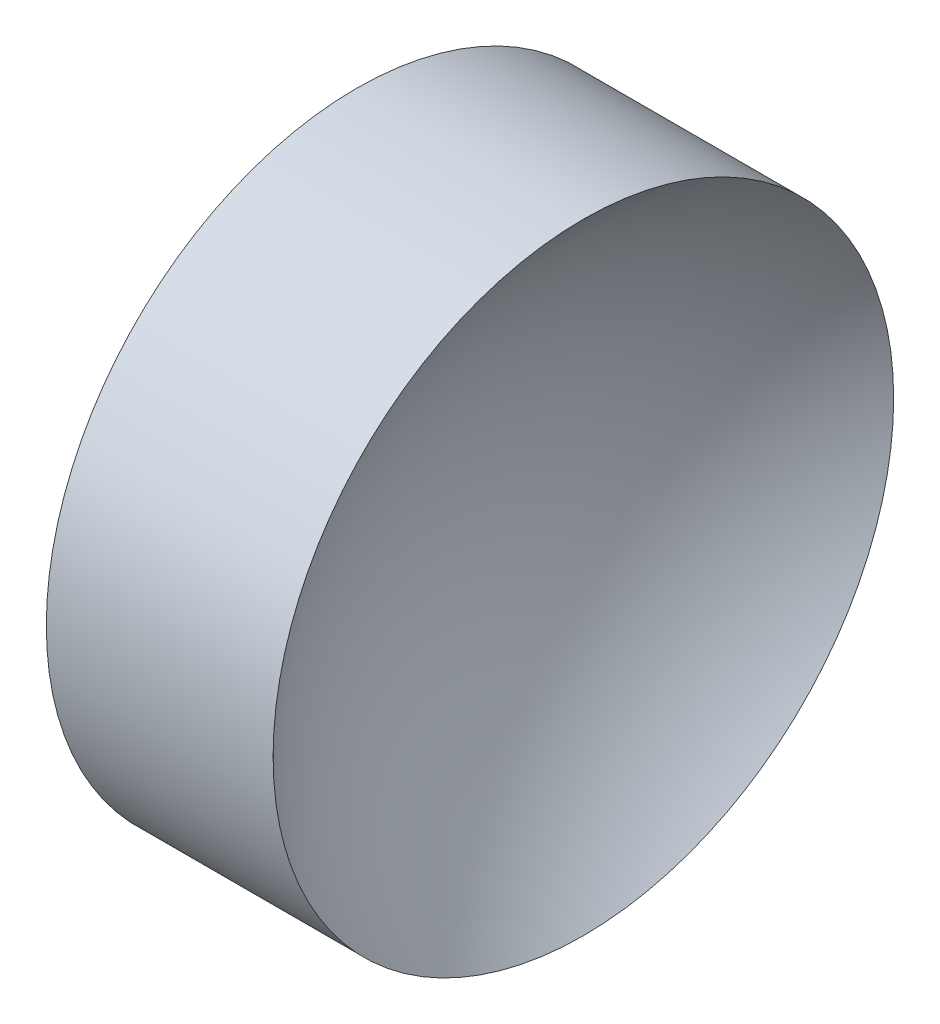
ISO-10303-21;
HEADER;
FILE_DESCRIPTION(('STEP AP214'),'2;1');
FILE_NAME('part.step','',(''),(''),'','','');
FILE_SCHEMA(('AUTOMOTIVE_DESIGN { 1 0 10303 214 1 1 1 1 }'));
ENDSEC;
DATA;
#1=APPLICATION_CONTEXT('core data for automotive mechanical design processes');
#2=APPLICATION_PROTOCOL_DEFINITION('international standard','automotive_design',2000,#1);
#3=PRODUCT_CONTEXT('',#1,'mechanical');
#4=PRODUCT('Part','Part','',(#3));
#5=PRODUCT_RELATED_PRODUCT_CATEGORY('part','',(#4));
#6=PRODUCT_DEFINITION_FORMATION('','',#4);
#7=PRODUCT_DEFINITION_CONTEXT('part definition',#1,'design');
#8=PRODUCT_DEFINITION('design','',#6,#7);
#9=PRODUCT_DEFINITION_SHAPE('','',#8);
#10=(LENGTH_UNIT() NAMED_UNIT(*) SI_UNIT(.MILLI.,.METRE.));
#11=(NAMED_UNIT(*) PLANE_ANGLE_UNIT() SI_UNIT($,.RADIAN.));
#12=(NAMED_UNIT(*) SI_UNIT($,.STERADIAN.) SOLID_ANGLE_UNIT());
#13=UNCERTAINTY_MEASURE_WITH_UNIT(LENGTH_MEASURE(1.E-05),#10,'distance_accuracy_value','');
#14=(GEOMETRIC_REPRESENTATION_CONTEXT(3) GLOBAL_UNCERTAINTY_ASSIGNED_CONTEXT((#13)) GLOBAL_UNIT_ASSIGNED_CONTEXT((#10,
#11,#12)) REPRESENTATION_CONTEXT('',''));
#15=CARTESIAN_POINT('',(0.,0.,0.));
#16=DIRECTION('',(0.,0.,1.));
#17=DIRECTION('',(1.,0.,0.));
#18=AXIS2_PLACEMENT_3D('',#15,#16,#17);
#19=CARTESIAN_POINT('',(49.7458273254976,26.0622521828061,0.));
#20=DIRECTION('',(-1.,0.,0.));
#21=DIRECTION('',(0.,-1.,0.));
#22=AXIS2_PLACEMENT_3D('',#19,#20,#21);
#23=SPHERICAL_SURFACE('',#22,6.87999999999999);
#24=CARTESIAN_POINT('',(45.0198988452939,26.0622521828061,0.));
#25=DIRECTION('',(-1.,0.,0.));
#26=DIRECTION('',(0.,0.,1.));
#27=AXIS2_PLACEMENT_3D('',#24,#25,#26);
#28=CIRCLE('',#27,5.);
#29=CARTESIAN_POINT('',(45.0198988452939,26.0622521828061,5.));
#30=VERTEX_POINT('',#29);
#31=EDGE_CURVE('E10',#30,#30,#28,.T.);
#32=ORIENTED_EDGE('',*,*,#31,.F.);
#33=EDGE_LOOP('',(#32));
#34=FACE_BOUND('',#33,.T.);
#35=ADVANCED_FACE('F35',(#34),#23,.F.);
#36=CARTESIAN_POINT('',(39.7365000133641,26.0622521828061,0.));
#37=DIRECTION('',(-1.,0.,0.));
#38=DIRECTION('',(0.,0.,1.));
#39=AXIS2_PLACEMENT_3D('',#36,#37,#38);
#40=CYLINDRICAL_SURFACE('',#39,5.);
#41=CARTESIAN_POINT('',(41.3658273254976,26.0622521828061,0.));
#42=DIRECTION('',(-1.,0.,0.));
#43=DIRECTION('',(0.,0.,1.));
#44=AXIS2_PLACEMENT_3D('',#41,#42,#43);
#45=CIRCLE('',#44,5.);
#46=CARTESIAN_POINT('',(41.3658273254976,26.0622521828061,5.));
#47=VERTEX_POINT('',#46);
#48=EDGE_CURVE('E41',#47,#47,#45,.T.);
#49=ORIENTED_EDGE('',*,*,#48,.F.);
#50=EDGE_LOOP('',(#49));
#51=FACE_BOUND('',#50,.T.);
#52=ORIENTED_EDGE('',*,*,#31,.T.);
#53=EDGE_LOOP('',(#52));
#54=FACE_BOUND('',#53,.T.);
#55=ADVANCED_FACE('F49',(#51,#54),#40,.T.);
#56=CARTESIAN_POINT('',(41.3658273254976,26.0622521828061,0.));
#57=DIRECTION('',(1.,0.,0.));
#58=DIRECTION('',(0.,0.,-1.));
#59=AXIS2_PLACEMENT_3D('',#56,#57,#58);
#60=PLANE('',#59);
#61=ORIENTED_EDGE('',*,*,#48,.T.);
#62=EDGE_LOOP('',(#61));
#63=FACE_BOUND('',#62,.T.);
#64=ADVANCED_FACE('F47',(#63),#60,.F.);
#65=CLOSED_SHELL('',(#35,#55,#64));
#66=MANIFOLD_SOLID_BREP('B2',#65);
#67=ADVANCED_BREP_SHAPE_REPRESENTATION('',(#18,#66),#14);
#68=SHAPE_DEFINITION_REPRESENTATION(#9,#67);
ENDSEC;
END-ISO-10303-21;
